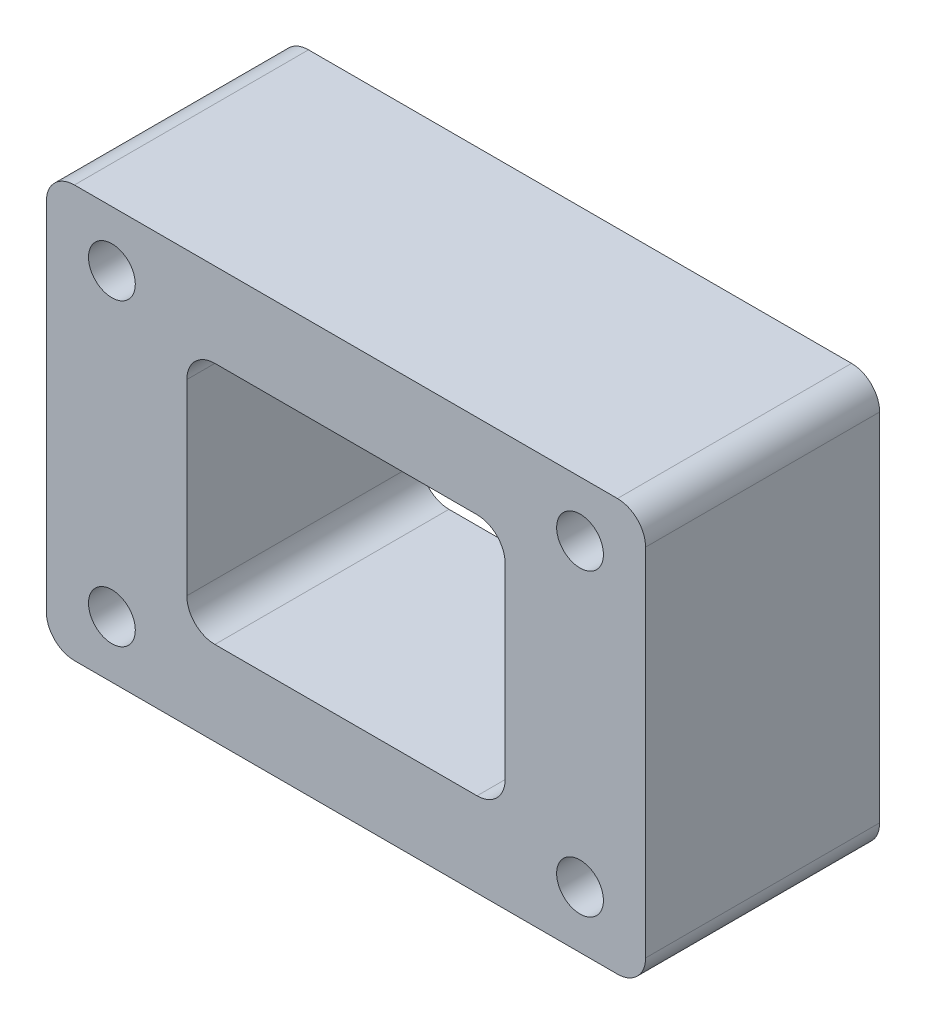
ISO-10303-21;
HEADER;
FILE_DESCRIPTION(('STEP AP214'),'2;1');
FILE_NAME('part.step','',(''),(''),'','','');
FILE_SCHEMA(('AUTOMOTIVE_DESIGN { 1 0 10303 214 1 1 1 1 }'));
ENDSEC;
DATA;
#1=APPLICATION_CONTEXT('core data for automotive mechanical design processes');
#2=APPLICATION_PROTOCOL_DEFINITION('international standard','automotive_design',2000,#1);
#3=PRODUCT_CONTEXT('',#1,'mechanical');
#4=PRODUCT('Part','Part','',(#3));
#5=PRODUCT_RELATED_PRODUCT_CATEGORY('part','',(#4));
#6=PRODUCT_DEFINITION_FORMATION('','',#4);
#7=PRODUCT_DEFINITION_CONTEXT('part definition',#1,'design');
#8=PRODUCT_DEFINITION('design','',#6,#7);
#9=PRODUCT_DEFINITION_SHAPE('','',#8);
#10=(LENGTH_UNIT() NAMED_UNIT(*) SI_UNIT(.MILLI.,.METRE.));
#11=(NAMED_UNIT(*) PLANE_ANGLE_UNIT() SI_UNIT($,.RADIAN.));
#12=(NAMED_UNIT(*) SI_UNIT($,.STERADIAN.) SOLID_ANGLE_UNIT());
#13=UNCERTAINTY_MEASURE_WITH_UNIT(LENGTH_MEASURE(1.E-05),#10,'distance_accuracy_value','');
#14=(GEOMETRIC_REPRESENTATION_CONTEXT(3) GLOBAL_UNCERTAINTY_ASSIGNED_CONTEXT((#13)) GLOBAL_UNIT_ASSIGNED_CONTEXT((#10,
#11,#12)) REPRESENTATION_CONTEXT('',''));
#15=CARTESIAN_POINT('',(0.,0.,0.));
#16=DIRECTION('',(0.,0.,1.));
#17=DIRECTION('',(1.,0.,0.));
#18=AXIS2_PLACEMENT_3D('',#15,#16,#17);
#19=CARTESIAN_POINT('',(0.,0.,25.));
#20=DIRECTION('',(0.,0.,1.));
#21=DIRECTION('',(1.,0.,0.));
#22=AXIS2_PLACEMENT_3D('',#19,#20,#21);
#23=PLANE('',#22);
#24=CARTESIAN_POINT('',(24.9999999999999,-15.9322033898305,25.));
#25=DIRECTION('',(0.,0.,1.));
#26=DIRECTION('',(-1.,0.,0.));
#27=AXIS2_PLACEMENT_3D('',#24,#25,#26);
#28=CIRCLE('',#27,2.5);
#29=CARTESIAN_POINT('',(22.4999999999999,-15.9322033898305,25.));
#30=VERTEX_POINT('',#29);
#31=EDGE_CURVE('E272',#30,#30,#28,.T.);
#32=ORIENTED_EDGE('',*,*,#31,.F.);
#33=EDGE_LOOP('',(#32));
#34=FACE_BOUND('',#33,.T.);
#35=CARTESIAN_POINT('',(-25.,16.0677966101695,25.));
#36=DIRECTION('',(0.,0.,1.));
#37=DIRECTION('',(1.,0.,0.));
#38=AXIS2_PLACEMENT_3D('',#35,#36,#37);
#39=CIRCLE('',#38,2.5);
#40=CARTESIAN_POINT('',(-22.5,16.0677966101695,25.));
#41=VERTEX_POINT('',#40);
#42=EDGE_CURVE('E280',#41,#41,#39,.T.);
#43=ORIENTED_EDGE('',*,*,#42,.F.);
#44=EDGE_LOOP('',(#43));
#45=FACE_BOUND('',#44,.T.);
#46=DIRECTION('',(0.,-1.,0.));
#47=VECTOR('',#46,1.);
#48=CARTESIAN_POINT('',(-32.,22.,25.));
#49=LINE('',#48,#47);
#50=CARTESIAN_POINT('',(-32.,19.,25.));
#51=VERTEX_POINT('',#50);
#52=CARTESIAN_POINT('',(-32.,-19.,25.));
#53=VERTEX_POINT('',#52);
#54=EDGE_CURVE('E177',#51,#53,#49,.T.);
#55=ORIENTED_EDGE('',*,*,#54,.T.);
#56=CARTESIAN_POINT('',(-29.,-19.,25.));
#57=DIRECTION('',(0.,0.,1.));
#58=DIRECTION('',(1.,0.,0.));
#59=AXIS2_PLACEMENT_3D('',#56,#57,#58);
#60=CIRCLE('',#59,3.);
#61=CARTESIAN_POINT('',(-29.,-22.,25.));
#62=VERTEX_POINT('',#61);
#63=EDGE_CURVE('E219',#53,#62,#60,.T.);
#64=ORIENTED_EDGE('',*,*,#63,.T.);
#65=DIRECTION('',(1.,0.,0.));
#66=VECTOR('',#65,1.);
#67=CARTESIAN_POINT('',(-32.,-22.,25.));
#68=LINE('',#67,#66);
#69=CARTESIAN_POINT('',(29.,-22.,25.));
#70=VERTEX_POINT('',#69);
#71=EDGE_CURVE('E172',#62,#70,#68,.T.);
#72=ORIENTED_EDGE('',*,*,#71,.T.);
#73=CARTESIAN_POINT('',(29.,-19.,25.));
#74=DIRECTION('',(0.,0.,1.));
#75=DIRECTION('',(1.,0.,0.));
#76=AXIS2_PLACEMENT_3D('',#73,#74,#75);
#77=CIRCLE('',#76,3.);
#78=CARTESIAN_POINT('',(32.,-19.,25.));
#79=VERTEX_POINT('',#78);
#80=EDGE_CURVE('E215',#70,#79,#77,.T.);
#81=ORIENTED_EDGE('',*,*,#80,.T.);
#82=DIRECTION('',(0.,1.,0.));
#83=VECTOR('',#82,1.);
#84=CARTESIAN_POINT('',(32.,22.,25.));
#85=LINE('',#84,#83);
#86=CARTESIAN_POINT('',(32.,19.,25.));
#87=VERTEX_POINT('',#86);
#88=EDGE_CURVE('E286',#79,#87,#85,.T.);
#89=ORIENTED_EDGE('',*,*,#88,.T.);
#90=CARTESIAN_POINT('',(29.,19.,25.));
#91=DIRECTION('',(0.,0.,1.));
#92=DIRECTION('',(1.,0.,0.));
#93=AXIS2_PLACEMENT_3D('',#90,#91,#92);
#94=CIRCLE('',#93,3.);
#95=CARTESIAN_POINT('',(29.,22.,25.));
#96=VERTEX_POINT('',#95);
#97=EDGE_CURVE('E54',#87,#96,#94,.T.);
#98=ORIENTED_EDGE('',*,*,#97,.T.);
#99=DIRECTION('',(-1.,0.,0.));
#100=VECTOR('',#99,1.);
#101=CARTESIAN_POINT('',(-32.,22.,25.));
#102=LINE('',#101,#100);
#103=CARTESIAN_POINT('',(-29.,22.,25.));
#104=VERTEX_POINT('',#103);
#105=EDGE_CURVE('E288',#96,#104,#102,.T.);
#106=ORIENTED_EDGE('',*,*,#105,.T.);
#107=CARTESIAN_POINT('',(-29.,19.,25.));
#108=DIRECTION('',(0.,0.,1.));
#109=DIRECTION('',(1.,0.,0.));
#110=AXIS2_PLACEMENT_3D('',#107,#108,#109);
#111=CIRCLE('',#110,3.);
#112=EDGE_CURVE('E217',#104,#51,#111,.T.);
#113=ORIENTED_EDGE('',*,*,#112,.T.);
#114=EDGE_LOOP('',(#55,#64,#72,#81,#89,#98,#106,#113));
#115=FACE_BOUND('',#114,.T.);
#116=CARTESIAN_POINT('',(-25.,-15.9322033898305,25.));
#117=DIRECTION('',(0.,0.,1.));
#118=DIRECTION('',(1.,0.,0.));
#119=AXIS2_PLACEMENT_3D('',#116,#117,#118);
#120=CIRCLE('',#119,2.5);
#121=CARTESIAN_POINT('',(-22.5,-15.9322033898305,25.));
#122=VERTEX_POINT('',#121);
#123=EDGE_CURVE('E274',#122,#122,#120,.T.);
#124=ORIENTED_EDGE('',*,*,#123,.F.);
#125=EDGE_LOOP('',(#124));
#126=FACE_BOUND('',#125,.T.);
#127=DIRECTION('',(-1.,0.,0.));
#128=VECTOR('',#127,1.);
#129=CARTESIAN_POINT('',(-17.,13.,25.));
#130=LINE('',#129,#128);
#131=CARTESIAN_POINT('',(14.,13.,25.));
#132=VERTEX_POINT('',#131);
#133=CARTESIAN_POINT('',(-14.,13.,25.));
#134=VERTEX_POINT('',#133);
#135=EDGE_CURVE('E254',#132,#134,#130,.T.);
#136=ORIENTED_EDGE('',*,*,#135,.F.);
#137=CARTESIAN_POINT('',(14.,10.,25.));
#138=DIRECTION('',(0.,0.,1.));
#139=DIRECTION('',(1.,0.,0.));
#140=AXIS2_PLACEMENT_3D('',#137,#138,#139);
#141=CIRCLE('',#140,3.);
#142=CARTESIAN_POINT('',(17.,10.,25.));
#143=VERTEX_POINT('',#142);
#144=EDGE_CURVE('E158',#132,#143,#141,.F.);
#145=ORIENTED_EDGE('',*,*,#144,.T.);
#146=DIRECTION('',(0.,1.,0.));
#147=VECTOR('',#146,1.);
#148=CARTESIAN_POINT('',(17.,13.,25.));
#149=LINE('',#148,#147);
#150=CARTESIAN_POINT('',(17.,-9.99999999999999,25.));
#151=VERTEX_POINT('',#150);
#152=EDGE_CURVE('E168',#151,#143,#149,.T.);
#153=ORIENTED_EDGE('',*,*,#152,.F.);
#154=CARTESIAN_POINT('',(14.,-9.99999999999999,25.));
#155=DIRECTION('',(0.,0.,1.));
#156=DIRECTION('',(1.,0.,0.));
#157=AXIS2_PLACEMENT_3D('',#154,#155,#156);
#158=CIRCLE('',#157,3.);
#159=CARTESIAN_POINT('',(14.,-13.,25.));
#160=VERTEX_POINT('',#159);
#161=EDGE_CURVE('E232',#151,#160,#158,.F.);
#162=ORIENTED_EDGE('',*,*,#161,.T.);
#163=DIRECTION('',(1.,0.,0.));
#164=VECTOR('',#163,1.);
#165=CARTESIAN_POINT('',(-17.,-13.,25.));
#166=LINE('',#165,#164);
#167=CARTESIAN_POINT('',(-14.,-13.,25.));
#168=VERTEX_POINT('',#167);
#169=EDGE_CURVE('E261',#168,#160,#166,.T.);
#170=ORIENTED_EDGE('',*,*,#169,.F.);
#171=CARTESIAN_POINT('',(-14.,-9.99999999999999,25.));
#172=DIRECTION('',(0.,0.,1.));
#173=DIRECTION('',(1.,0.,0.));
#174=AXIS2_PLACEMENT_3D('',#171,#172,#173);
#175=CIRCLE('',#174,3.);
#176=CARTESIAN_POINT('',(-17.,-9.99999999999999,25.));
#177=VERTEX_POINT('',#176);
#178=EDGE_CURVE('E157',#168,#177,#175,.F.);
#179=ORIENTED_EDGE('',*,*,#178,.T.);
#180=DIRECTION('',(0.,-1.,0.));
#181=VECTOR('',#180,1.);
#182=CARTESIAN_POINT('',(-17.,13.,25.));
#183=LINE('',#182,#181);
#184=CARTESIAN_POINT('',(-17.,10.,25.));
#185=VERTEX_POINT('',#184);
#186=EDGE_CURVE('E256',#185,#177,#183,.T.);
#187=ORIENTED_EDGE('',*,*,#186,.F.);
#188=CARTESIAN_POINT('',(-14.,10.,25.));
#189=DIRECTION('',(0.,0.,1.));
#190=DIRECTION('',(1.,0.,0.));
#191=AXIS2_PLACEMENT_3D('',#188,#189,#190);
#192=CIRCLE('',#191,3.);
#193=EDGE_CURVE('E11',#185,#134,#192,.F.);
#194=ORIENTED_EDGE('',*,*,#193,.T.);
#195=EDGE_LOOP('',(#136,#145,#153,#162,#170,#179,#187,#194));
#196=FACE_BOUND('',#195,.T.);
#197=CARTESIAN_POINT('',(25.,16.0677966101694,25.));
#198=DIRECTION('',(0.,0.,1.));
#199=DIRECTION('',(-1.,0.,0.));
#200=AXIS2_PLACEMENT_3D('',#197,#198,#199);
#201=CIRCLE('',#200,2.5);
#202=CARTESIAN_POINT('',(22.5,16.0677966101694,25.));
#203=VERTEX_POINT('',#202);
#204=EDGE_CURVE('E540',#203,#203,#201,.T.);
#205=ORIENTED_EDGE('',*,*,#204,.F.);
#206=EDGE_LOOP('',(#205));
#207=FACE_BOUND('',#206,.T.);
#208=ADVANCED_FACE('F32',(#34,#45,#115,#126,#196,#207),#23,.T.);
#209=CARTESIAN_POINT('',(0.,0.,0.));
#210=DIRECTION('',(0.,0.,1.));
#211=DIRECTION('',(1.,0.,0.));
#212=AXIS2_PLACEMENT_3D('',#209,#210,#211);
#213=PLANE('',#212);
#214=CARTESIAN_POINT('',(-25.,-15.9322033898305,0.));
#215=DIRECTION('',(0.,0.,1.));
#216=DIRECTION('',(1.,0.,0.));
#217=AXIS2_PLACEMENT_3D('',#214,#215,#216);
#218=CIRCLE('',#217,2.5);
#219=CARTESIAN_POINT('',(-22.5,-15.9322033898305,0.));
#220=VERTEX_POINT('',#219);
#221=EDGE_CURVE('E268',#220,#220,#218,.T.);
#222=ORIENTED_EDGE('',*,*,#221,.T.);
#223=EDGE_LOOP('',(#222));
#224=FACE_BOUND('',#223,.T.);
#225=CARTESIAN_POINT('',(-25.,16.0677966101695,0.));
#226=DIRECTION('',(0.,0.,1.));
#227=DIRECTION('',(1.,0.,0.));
#228=AXIS2_PLACEMENT_3D('',#225,#226,#227);
#229=CIRCLE('',#228,2.5);
#230=CARTESIAN_POINT('',(-22.5,16.0677966101695,0.));
#231=VERTEX_POINT('',#230);
#232=EDGE_CURVE('E277',#231,#231,#229,.T.);
#233=ORIENTED_EDGE('',*,*,#232,.T.);
#234=EDGE_LOOP('',(#233));
#235=FACE_BOUND('',#234,.T.);
#236=DIRECTION('',(1.,0.,0.));
#237=VECTOR('',#236,1.);
#238=CARTESIAN_POINT('',(-32.,-22.,0.));
#239=LINE('',#238,#237);
#240=CARTESIAN_POINT('',(-29.,-22.,0.));
#241=VERTEX_POINT('',#240);
#242=CARTESIAN_POINT('',(29.,-22.,0.));
#243=VERTEX_POINT('',#242);
#244=EDGE_CURVE('E180',#241,#243,#239,.T.);
#245=ORIENTED_EDGE('',*,*,#244,.F.);
#246=CARTESIAN_POINT('',(-29.,-19.,0.));
#247=DIRECTION('',(0.,0.,1.));
#248=DIRECTION('',(1.,0.,0.));
#249=AXIS2_PLACEMENT_3D('',#246,#247,#248);
#250=CIRCLE('',#249,3.);
#251=CARTESIAN_POINT('',(-32.,-19.,0.));
#252=VERTEX_POINT('',#251);
#253=EDGE_CURVE('E207',#241,#252,#250,.F.);
#254=ORIENTED_EDGE('',*,*,#253,.T.);
#255=DIRECTION('',(0.,-1.,0.));
#256=VECTOR('',#255,1.);
#257=CARTESIAN_POINT('',(-32.,22.,0.));
#258=LINE('',#257,#256);
#259=CARTESIAN_POINT('',(-32.,19.,0.));
#260=VERTEX_POINT('',#259);
#261=EDGE_CURVE('E295',#260,#252,#258,.T.);
#262=ORIENTED_EDGE('',*,*,#261,.F.);
#263=CARTESIAN_POINT('',(-29.,19.,0.));
#264=DIRECTION('',(0.,0.,1.));
#265=DIRECTION('',(1.,0.,0.));
#266=AXIS2_PLACEMENT_3D('',#263,#264,#265);
#267=CIRCLE('',#266,3.);
#268=CARTESIAN_POINT('',(-29.,22.,0.));
#269=VERTEX_POINT('',#268);
#270=EDGE_CURVE('E205',#260,#269,#267,.F.);
#271=ORIENTED_EDGE('',*,*,#270,.T.);
#272=DIRECTION('',(-1.,0.,0.));
#273=VECTOR('',#272,1.);
#274=CARTESIAN_POINT('',(-32.,22.,0.));
#275=LINE('',#274,#273);
#276=CARTESIAN_POINT('',(29.,22.,0.));
#277=VERTEX_POINT('',#276);
#278=EDGE_CURVE('E294',#277,#269,#275,.T.);
#279=ORIENTED_EDGE('',*,*,#278,.F.);
#280=CARTESIAN_POINT('',(29.,19.,0.));
#281=DIRECTION('',(0.,0.,1.));
#282=DIRECTION('',(1.,0.,0.));
#283=AXIS2_PLACEMENT_3D('',#280,#281,#282);
#284=CIRCLE('',#283,3.);
#285=CARTESIAN_POINT('',(32.,19.,0.));
#286=VERTEX_POINT('',#285);
#287=EDGE_CURVE('E201',#277,#286,#284,.F.);
#288=ORIENTED_EDGE('',*,*,#287,.T.);
#289=DIRECTION('',(0.,1.,0.));
#290=VECTOR('',#289,1.);
#291=CARTESIAN_POINT('',(32.,22.,0.));
#292=LINE('',#291,#290);
#293=CARTESIAN_POINT('',(32.,-19.,0.));
#294=VERTEX_POINT('',#293);
#295=EDGE_CURVE('E283',#294,#286,#292,.T.);
#296=ORIENTED_EDGE('',*,*,#295,.F.);
#297=CARTESIAN_POINT('',(29.,-19.,0.));
#298=DIRECTION('',(0.,0.,1.));
#299=DIRECTION('',(1.,0.,0.));
#300=AXIS2_PLACEMENT_3D('',#297,#298,#299);
#301=CIRCLE('',#300,3.);
#302=EDGE_CURVE('E203',#294,#243,#301,.F.);
#303=ORIENTED_EDGE('',*,*,#302,.T.);
#304=EDGE_LOOP('',(#245,#254,#262,#271,#279,#288,#296,#303));
#305=FACE_BOUND('',#304,.T.);
#306=DIRECTION('',(1.,0.,0.));
#307=VECTOR('',#306,1.);
#308=CARTESIAN_POINT('',(-17.,-13.,0.));
#309=LINE('',#308,#307);
#310=CARTESIAN_POINT('',(-14.,-13.,0.));
#311=VERTEX_POINT('',#310);
#312=CARTESIAN_POINT('',(14.,-13.,0.));
#313=VERTEX_POINT('',#312);
#314=EDGE_CURVE('E150',#311,#313,#309,.T.);
#315=ORIENTED_EDGE('',*,*,#314,.T.);
#316=CARTESIAN_POINT('',(14.,-9.99999999999999,0.));
#317=DIRECTION('',(0.,0.,1.));
#318=DIRECTION('',(1.,0.,0.));
#319=AXIS2_PLACEMENT_3D('',#316,#317,#318);
#320=CIRCLE('',#319,3.);
#321=CARTESIAN_POINT('',(17.,-9.99999999999999,0.));
#322=VERTEX_POINT('',#321);
#323=EDGE_CURVE('E230',#313,#322,#320,.T.);
#324=ORIENTED_EDGE('',*,*,#323,.T.);
#325=DIRECTION('',(0.,1.,0.));
#326=VECTOR('',#325,1.);
#327=CARTESIAN_POINT('',(17.,13.,0.));
#328=LINE('',#327,#326);
#329=CARTESIAN_POINT('',(17.,10.,0.));
#330=VERTEX_POINT('',#329);
#331=EDGE_CURVE('E269',#322,#330,#328,.T.);
#332=ORIENTED_EDGE('',*,*,#331,.T.);
#333=CARTESIAN_POINT('',(14.,10.,0.));
#334=DIRECTION('',(0.,0.,1.));
#335=DIRECTION('',(1.,0.,0.));
#336=AXIS2_PLACEMENT_3D('',#333,#334,#335);
#337=CIRCLE('',#336,3.);
#338=CARTESIAN_POINT('',(14.,13.,0.));
#339=VERTEX_POINT('',#338);
#340=EDGE_CURVE('E234',#330,#339,#337,.T.);
#341=ORIENTED_EDGE('',*,*,#340,.T.);
#342=DIRECTION('',(-1.,0.,0.));
#343=VECTOR('',#342,1.);
#344=CARTESIAN_POINT('',(-17.,13.,0.));
#345=LINE('',#344,#343);
#346=CARTESIAN_POINT('',(-14.,13.,0.));
#347=VERTEX_POINT('',#346);
#348=EDGE_CURVE('E239',#339,#347,#345,.T.);
#349=ORIENTED_EDGE('',*,*,#348,.T.);
#350=CARTESIAN_POINT('',(-14.,10.,0.));
#351=DIRECTION('',(0.,0.,1.));
#352=DIRECTION('',(1.,0.,0.));
#353=AXIS2_PLACEMENT_3D('',#350,#351,#352);
#354=CIRCLE('',#353,3.);
#355=CARTESIAN_POINT('',(-17.,10.,0.));
#356=VERTEX_POINT('',#355);
#357=EDGE_CURVE('E40',#347,#356,#354,.T.);
#358=ORIENTED_EDGE('',*,*,#357,.T.);
#359=DIRECTION('',(0.,-1.,0.));
#360=VECTOR('',#359,1.);
#361=CARTESIAN_POINT('',(-17.,13.,0.));
#362=LINE('',#361,#360);
#363=CARTESIAN_POINT('',(-17.,-9.99999999999999,0.));
#364=VERTEX_POINT('',#363);
#365=EDGE_CURVE('E152',#356,#364,#362,.T.);
#366=ORIENTED_EDGE('',*,*,#365,.T.);
#367=CARTESIAN_POINT('',(-14.,-9.99999999999999,0.));
#368=DIRECTION('',(0.,0.,1.));
#369=DIRECTION('',(1.,0.,0.));
#370=AXIS2_PLACEMENT_3D('',#367,#368,#369);
#371=CIRCLE('',#370,3.);
#372=EDGE_CURVE('E146',#364,#311,#371,.T.);
#373=ORIENTED_EDGE('',*,*,#372,.T.);
#374=EDGE_LOOP('',(#315,#324,#332,#341,#349,#358,#366,#373));
#375=FACE_BOUND('',#374,.T.);
#376=CARTESIAN_POINT('',(24.9999999999999,-15.9322033898305,0.));
#377=DIRECTION('',(0.,0.,1.));
#378=DIRECTION('',(-1.,0.,0.));
#379=AXIS2_PLACEMENT_3D('',#376,#377,#378);
#380=CIRCLE('',#379,2.5);
#381=CARTESIAN_POINT('',(22.4999999999999,-15.9322033898305,0.));
#382=VERTEX_POINT('',#381);
#383=EDGE_CURVE('E539',#382,#382,#380,.T.);
#384=ORIENTED_EDGE('',*,*,#383,.T.);
#385=EDGE_LOOP('',(#384));
#386=FACE_BOUND('',#385,.T.);
#387=CARTESIAN_POINT('',(25.,16.0677966101694,0.));
#388=DIRECTION('',(0.,0.,1.));
#389=DIRECTION('',(-1.,0.,0.));
#390=AXIS2_PLACEMENT_3D('',#387,#388,#389);
#391=CIRCLE('',#390,2.5);
#392=CARTESIAN_POINT('',(22.5,16.0677966101694,0.));
#393=VERTEX_POINT('',#392);
#394=EDGE_CURVE('E543',#393,#393,#391,.T.);
#395=ORIENTED_EDGE('',*,*,#394,.T.);
#396=EDGE_LOOP('',(#395));
#397=FACE_BOUND('',#396,.T.);
#398=ADVANCED_FACE('F148',(#224,#235,#305,#375,#386,#397),#213,.F.);
#399=CARTESIAN_POINT('',(32.,22.,25.));
#400=DIRECTION('',(-1.,0.,0.));
#401=DIRECTION('',(0.,0.,1.));
#402=AXIS2_PLACEMENT_3D('',#399,#400,#401);
#403=PLANE('',#402);
#404=ORIENTED_EDGE('',*,*,#88,.F.);
#405=DIRECTION('',(0.,0.,-1.));
#406=VECTOR('',#405,1.);
#407=CARTESIAN_POINT('',(32.,-19.,25.));
#408=LINE('',#407,#406);
#409=EDGE_CURVE('E227',#79,#294,#408,.T.);
#410=ORIENTED_EDGE('',*,*,#409,.T.);
#411=ORIENTED_EDGE('',*,*,#295,.T.);
#412=DIRECTION('',(0.,0.,-1.));
#413=VECTOR('',#412,1.);
#414=CARTESIAN_POINT('',(32.,19.,25.));
#415=LINE('',#414,#413);
#416=EDGE_CURVE('E225',#286,#87,#415,.F.);
#417=ORIENTED_EDGE('',*,*,#416,.T.);
#418=EDGE_LOOP('',(#404,#410,#411,#417));
#419=FACE_BOUND('',#418,.T.);
#420=ADVANCED_FACE('F315',(#419),#403,.F.);
#421=CARTESIAN_POINT('',(-32.,22.,25.));
#422=DIRECTION('',(0.,-1.,0.));
#423=DIRECTION('',(0.,0.,-1.));
#424=AXIS2_PLACEMENT_3D('',#421,#422,#423);
#425=PLANE('',#424);
#426=ORIENTED_EDGE('',*,*,#278,.T.);
#427=DIRECTION('',(0.,0.,-1.));
#428=VECTOR('',#427,1.);
#429=CARTESIAN_POINT('',(-29.,22.,25.));
#430=LINE('',#429,#428);
#431=EDGE_CURVE('E47',#269,#104,#430,.F.);
#432=ORIENTED_EDGE('',*,*,#431,.T.);
#433=ORIENTED_EDGE('',*,*,#105,.F.);
#434=DIRECTION('',(0.,0.,-1.));
#435=VECTOR('',#434,1.);
#436=CARTESIAN_POINT('',(29.,22.,25.));
#437=LINE('',#436,#435);
#438=EDGE_CURVE('E221',#96,#277,#437,.T.);
#439=ORIENTED_EDGE('',*,*,#438,.T.);
#440=EDGE_LOOP('',(#426,#432,#433,#439));
#441=FACE_BOUND('',#440,.T.);
#442=ADVANCED_FACE('F321',(#441),#425,.F.);
#443=CARTESIAN_POINT('',(-32.,22.,25.));
#444=DIRECTION('',(1.,0.,0.));
#445=DIRECTION('',(0.,1.,0.));
#446=AXIS2_PLACEMENT_3D('',#443,#444,#445);
#447=PLANE('',#446);
#448=ORIENTED_EDGE('',*,*,#261,.T.);
#449=DIRECTION('',(0.,0.,-1.));
#450=VECTOR('',#449,1.);
#451=CARTESIAN_POINT('',(-32.,-19.,25.));
#452=LINE('',#451,#450);
#453=EDGE_CURVE('E212',#252,#53,#452,.F.);
#454=ORIENTED_EDGE('',*,*,#453,.T.);
#455=ORIENTED_EDGE('',*,*,#54,.F.);
#456=DIRECTION('',(0.,0.,-1.));
#457=VECTOR('',#456,1.);
#458=CARTESIAN_POINT('',(-32.,19.,25.));
#459=LINE('',#458,#457);
#460=EDGE_CURVE('E209',#51,#260,#459,.T.);
#461=ORIENTED_EDGE('',*,*,#460,.T.);
#462=EDGE_LOOP('',(#448,#454,#455,#461));
#463=FACE_BOUND('',#462,.T.);
#464=ADVANCED_FACE('F327',(#463),#447,.F.);
#465=CARTESIAN_POINT('',(-32.,-22.,25.));
#466=DIRECTION('',(0.,1.,0.));
#467=DIRECTION('',(0.,0.,1.));
#468=AXIS2_PLACEMENT_3D('',#465,#466,#467);
#469=PLANE('',#468);
#470=ORIENTED_EDGE('',*,*,#71,.F.);
#471=DIRECTION('',(0.,0.,-1.));
#472=VECTOR('',#471,1.);
#473=CARTESIAN_POINT('',(-29.,-22.,25.));
#474=LINE('',#473,#472);
#475=EDGE_CURVE('E198',#62,#241,#474,.T.);
#476=ORIENTED_EDGE('',*,*,#475,.T.);
#477=ORIENTED_EDGE('',*,*,#244,.T.);
#478=DIRECTION('',(0.,0.,-1.));
#479=VECTOR('',#478,1.);
#480=CARTESIAN_POINT('',(29.,-22.,25.));
#481=LINE('',#480,#479);
#482=EDGE_CURVE('E196',#243,#70,#481,.F.);
#483=ORIENTED_EDGE('',*,*,#482,.T.);
#484=EDGE_LOOP('',(#470,#476,#477,#483));
#485=FACE_BOUND('',#484,.T.);
#486=ADVANCED_FACE('F305',(#485),#469,.F.);
#487=CARTESIAN_POINT('',(-25.,16.0677966101695,25.));
#488=DIRECTION('',(0.,0.,-1.));
#489=DIRECTION('',(-1.,0.,0.));
#490=AXIS2_PLACEMENT_3D('',#487,#488,#489);
#491=CYLINDRICAL_SURFACE('',#490,2.5);
#492=ORIENTED_EDGE('',*,*,#42,.T.);
#493=EDGE_LOOP('',(#492));
#494=FACE_BOUND('',#493,.T.);
#495=ORIENTED_EDGE('',*,*,#232,.F.);
#496=EDGE_LOOP('',(#495));
#497=FACE_BOUND('',#496,.T.);
#498=ADVANCED_FACE('F350',(#494,#497),#491,.F.);
#499=CARTESIAN_POINT('',(-25.,-15.9322033898305,25.));
#500=DIRECTION('',(0.,0.,-1.));
#501=DIRECTION('',(-1.,0.,0.));
#502=AXIS2_PLACEMENT_3D('',#499,#500,#501);
#503=CYLINDRICAL_SURFACE('',#502,2.5);
#504=ORIENTED_EDGE('',*,*,#123,.T.);
#505=EDGE_LOOP('',(#504));
#506=FACE_BOUND('',#505,.T.);
#507=ORIENTED_EDGE('',*,*,#221,.F.);
#508=EDGE_LOOP('',(#507));
#509=FACE_BOUND('',#508,.T.);
#510=ADVANCED_FACE('F464',(#506,#509),#503,.F.);
#511=CARTESIAN_POINT('',(17.,13.,25.));
#512=DIRECTION('',(-1.,0.,0.));
#513=DIRECTION('',(0.,0.,1.));
#514=AXIS2_PLACEMENT_3D('',#511,#512,#513);
#515=PLANE('',#514);
#516=ORIENTED_EDGE('',*,*,#331,.F.);
#517=DIRECTION('',(0.,0.,-1.));
#518=VECTOR('',#517,1.);
#519=CARTESIAN_POINT('',(17.,-9.99999999999999,25.));
#520=LINE('',#519,#518);
#521=EDGE_CURVE('E185',#322,#151,#520,.F.);
#522=ORIENTED_EDGE('',*,*,#521,.T.);
#523=ORIENTED_EDGE('',*,*,#152,.T.);
#524=DIRECTION('',(0.,0.,-1.));
#525=VECTOR('',#524,1.);
#526=CARTESIAN_POINT('',(17.,10.,0.));
#527=LINE('',#526,#525);
#528=EDGE_CURVE('E174',#143,#330,#527,.T.);
#529=ORIENTED_EDGE('',*,*,#528,.T.);
#530=EDGE_LOOP('',(#516,#522,#523,#529));
#531=FACE_BOUND('',#530,.T.);
#532=ADVANCED_FACE('F456',(#531),#515,.T.);
#533=CARTESIAN_POINT('',(-17.,13.,25.));
#534=DIRECTION('',(0.,-1.,0.));
#535=DIRECTION('',(0.,0.,-1.));
#536=AXIS2_PLACEMENT_3D('',#533,#534,#535);
#537=PLANE('',#536);
#538=ORIENTED_EDGE('',*,*,#348,.F.);
#539=DIRECTION('',(0.,0.,-1.));
#540=VECTOR('',#539,1.);
#541=CARTESIAN_POINT('',(14.,13.,25.));
#542=LINE('',#541,#540);
#543=EDGE_CURVE('E190',#339,#132,#542,.F.);
#544=ORIENTED_EDGE('',*,*,#543,.T.);
#545=ORIENTED_EDGE('',*,*,#135,.T.);
#546=DIRECTION('',(0.,0.,-1.));
#547=VECTOR('',#546,1.);
#548=CARTESIAN_POINT('',(-14.,13.,0.));
#549=LINE('',#548,#547);
#550=EDGE_CURVE('E187',#134,#347,#549,.T.);
#551=ORIENTED_EDGE('',*,*,#550,.T.);
#552=EDGE_LOOP('',(#538,#544,#545,#551));
#553=FACE_BOUND('',#552,.T.);
#554=ADVANCED_FACE('F258',(#553),#537,.T.);
#555=CARTESIAN_POINT('',(-17.,13.,25.));
#556=DIRECTION('',(1.,0.,0.));
#557=DIRECTION('',(0.,1.,0.));
#558=AXIS2_PLACEMENT_3D('',#555,#556,#557);
#559=PLANE('',#558);
#560=ORIENTED_EDGE('',*,*,#186,.T.);
#561=DIRECTION('',(0.,0.,-1.));
#562=VECTOR('',#561,1.);
#563=CARTESIAN_POINT('',(-17.,-9.99999999999999,0.));
#564=LINE('',#563,#562);
#565=EDGE_CURVE('E194',#177,#364,#564,.T.);
#566=ORIENTED_EDGE('',*,*,#565,.T.);
#567=ORIENTED_EDGE('',*,*,#365,.F.);
#568=DIRECTION('',(0.,0.,-1.));
#569=VECTOR('',#568,1.);
#570=CARTESIAN_POINT('',(-17.,10.,25.));
#571=LINE('',#570,#569);
#572=EDGE_CURVE('E192',#356,#185,#571,.F.);
#573=ORIENTED_EDGE('',*,*,#572,.T.);
#574=EDGE_LOOP('',(#560,#566,#567,#573));
#575=FACE_BOUND('',#574,.T.);
#576=ADVANCED_FACE('F245',(#575),#559,.T.);
#577=CARTESIAN_POINT('',(-17.,-13.,25.));
#578=DIRECTION('',(0.,1.,0.));
#579=DIRECTION('',(0.,0.,1.));
#580=AXIS2_PLACEMENT_3D('',#577,#578,#579);
#581=PLANE('',#580);
#582=ORIENTED_EDGE('',*,*,#169,.T.);
#583=DIRECTION('',(0.,0.,-1.));
#584=VECTOR('',#583,1.);
#585=CARTESIAN_POINT('',(14.,-13.,0.));
#586=LINE('',#585,#584);
#587=EDGE_CURVE('E167',#160,#313,#586,.T.);
#588=ORIENTED_EDGE('',*,*,#587,.T.);
#589=ORIENTED_EDGE('',*,*,#314,.F.);
#590=DIRECTION('',(0.,0.,-1.));
#591=VECTOR('',#590,1.);
#592=CARTESIAN_POINT('',(-14.,-13.,25.));
#593=LINE('',#592,#591);
#594=EDGE_CURVE('E164',#311,#168,#593,.F.);
#595=ORIENTED_EDGE('',*,*,#594,.T.);
#596=EDGE_LOOP('',(#582,#588,#589,#595));
#597=FACE_BOUND('',#596,.T.);
#598=ADVANCED_FACE('F163',(#597),#581,.T.);
#599=CARTESIAN_POINT('',(24.9999999999999,-15.9322033898305,25.));
#600=DIRECTION('',(0.,0.,-1.));
#601=DIRECTION('',(-1.,0.,0.));
#602=AXIS2_PLACEMENT_3D('',#599,#600,#601);
#603=CYLINDRICAL_SURFACE('',#602,2.5);
#604=ORIENTED_EDGE('',*,*,#31,.T.);
#605=EDGE_LOOP('',(#604));
#606=FACE_BOUND('',#605,.T.);
#607=ORIENTED_EDGE('',*,*,#383,.F.);
#608=EDGE_LOOP('',(#607));
#609=FACE_BOUND('',#608,.T.);
#610=ADVANCED_FACE('F425',(#606,#609),#603,.F.);
#611=CARTESIAN_POINT('',(25.,16.0677966101694,25.));
#612=DIRECTION('',(0.,0.,-1.));
#613=DIRECTION('',(-1.,0.,0.));
#614=AXIS2_PLACEMENT_3D('',#611,#612,#613);
#615=CYLINDRICAL_SURFACE('',#614,2.5);
#616=ORIENTED_EDGE('',*,*,#204,.T.);
#617=EDGE_LOOP('',(#616));
#618=FACE_BOUND('',#617,.T.);
#619=ORIENTED_EDGE('',*,*,#394,.F.);
#620=EDGE_LOOP('',(#619));
#621=FACE_BOUND('',#620,.T.);
#622=ADVANCED_FACE('F365',(#618,#621),#615,.F.);
#623=CARTESIAN_POINT('',(14.,-9.99999999999999,25.));
#624=DIRECTION('',(0.,0.,1.));
#625=DIRECTION('',(1.,0.,0.));
#626=AXIS2_PLACEMENT_3D('',#623,#624,#625);
#627=CYLINDRICAL_SURFACE('',#626,3.);
#628=ORIENTED_EDGE('',*,*,#161,.F.);
#629=ORIENTED_EDGE('',*,*,#521,.F.);
#630=ORIENTED_EDGE('',*,*,#323,.F.);
#631=ORIENTED_EDGE('',*,*,#587,.F.);
#632=EDGE_LOOP('',(#628,#629,#630,#631));
#633=FACE_BOUND('',#632,.T.);
#634=ADVANCED_FACE('F361',(#633),#627,.F.);
#635=CARTESIAN_POINT('',(14.,10.,25.));
#636=DIRECTION('',(0.,0.,1.));
#637=DIRECTION('',(1.,0.,0.));
#638=AXIS2_PLACEMENT_3D('',#635,#636,#637);
#639=CYLINDRICAL_SURFACE('',#638,3.);
#640=ORIENTED_EDGE('',*,*,#144,.F.);
#641=ORIENTED_EDGE('',*,*,#543,.F.);
#642=ORIENTED_EDGE('',*,*,#340,.F.);
#643=ORIENTED_EDGE('',*,*,#528,.F.);
#644=EDGE_LOOP('',(#640,#641,#642,#643));
#645=FACE_BOUND('',#644,.T.);
#646=ADVANCED_FACE('F364',(#645),#639,.F.);
#647=CARTESIAN_POINT('',(-14.,-9.99999999999999,25.));
#648=DIRECTION('',(0.,0.,1.));
#649=DIRECTION('',(1.,0.,0.));
#650=AXIS2_PLACEMENT_3D('',#647,#648,#649);
#651=CYLINDRICAL_SURFACE('',#650,3.);
#652=ORIENTED_EDGE('',*,*,#178,.F.);
#653=ORIENTED_EDGE('',*,*,#594,.F.);
#654=ORIENTED_EDGE('',*,*,#372,.F.);
#655=ORIENTED_EDGE('',*,*,#565,.F.);
#656=EDGE_LOOP('',(#652,#653,#654,#655));
#657=FACE_BOUND('',#656,.T.);
#658=ADVANCED_FACE('F171',(#657),#651,.F.);
#659=CARTESIAN_POINT('',(-14.,10.,25.));
#660=DIRECTION('',(0.,0.,1.));
#661=DIRECTION('',(1.,0.,0.));
#662=AXIS2_PLACEMENT_3D('',#659,#660,#661);
#663=CYLINDRICAL_SURFACE('',#662,3.);
#664=ORIENTED_EDGE('',*,*,#193,.F.);
#665=ORIENTED_EDGE('',*,*,#572,.F.);
#666=ORIENTED_EDGE('',*,*,#357,.F.);
#667=ORIENTED_EDGE('',*,*,#550,.F.);
#668=EDGE_LOOP('',(#664,#665,#666,#667));
#669=FACE_BOUND('',#668,.T.);
#670=ADVANCED_FACE('F249',(#669),#663,.F.);
#671=CARTESIAN_POINT('',(-29.,-19.,25.));
#672=DIRECTION('',(0.,0.,-1.));
#673=DIRECTION('',(-1.,0.,0.));
#674=AXIS2_PLACEMENT_3D('',#671,#672,#673);
#675=CYLINDRICAL_SURFACE('',#674,3.);
#676=ORIENTED_EDGE('',*,*,#63,.F.);
#677=ORIENTED_EDGE('',*,*,#453,.F.);
#678=ORIENTED_EDGE('',*,*,#253,.F.);
#679=ORIENTED_EDGE('',*,*,#475,.F.);
#680=EDGE_LOOP('',(#676,#677,#678,#679));
#681=FACE_BOUND('',#680,.T.);
#682=ADVANCED_FACE('F330',(#681),#675,.T.);
#683=CARTESIAN_POINT('',(-29.,19.,25.));
#684=DIRECTION('',(0.,0.,-1.));
#685=DIRECTION('',(-1.,0.,0.));
#686=AXIS2_PLACEMENT_3D('',#683,#684,#685);
#687=CYLINDRICAL_SURFACE('',#686,3.);
#688=ORIENTED_EDGE('',*,*,#112,.F.);
#689=ORIENTED_EDGE('',*,*,#431,.F.);
#690=ORIENTED_EDGE('',*,*,#270,.F.);
#691=ORIENTED_EDGE('',*,*,#460,.F.);
#692=EDGE_LOOP('',(#688,#689,#690,#691));
#693=FACE_BOUND('',#692,.T.);
#694=ADVANCED_FACE('F325',(#693),#687,.T.);
#695=CARTESIAN_POINT('',(29.,-19.,25.));
#696=DIRECTION('',(0.,0.,-1.));
#697=DIRECTION('',(-1.,0.,0.));
#698=AXIS2_PLACEMENT_3D('',#695,#696,#697);
#699=CYLINDRICAL_SURFACE('',#698,3.);
#700=ORIENTED_EDGE('',*,*,#80,.F.);
#701=ORIENTED_EDGE('',*,*,#482,.F.);
#702=ORIENTED_EDGE('',*,*,#302,.F.);
#703=ORIENTED_EDGE('',*,*,#409,.F.);
#704=EDGE_LOOP('',(#700,#701,#702,#703));
#705=FACE_BOUND('',#704,.T.);
#706=ADVANCED_FACE('F310',(#705),#699,.T.);
#707=CARTESIAN_POINT('',(29.,19.,25.));
#708=DIRECTION('',(0.,0.,-1.));
#709=DIRECTION('',(-1.,0.,0.));
#710=AXIS2_PLACEMENT_3D('',#707,#708,#709);
#711=CYLINDRICAL_SURFACE('',#710,3.);
#712=ORIENTED_EDGE('',*,*,#97,.F.);
#713=ORIENTED_EDGE('',*,*,#416,.F.);
#714=ORIENTED_EDGE('',*,*,#287,.F.);
#715=ORIENTED_EDGE('',*,*,#438,.F.);
#716=EDGE_LOOP('',(#712,#713,#714,#715));
#717=FACE_BOUND('',#716,.T.);
#718=ADVANCED_FACE('F34',(#717),#711,.T.);
#719=CLOSED_SHELL('',(#208,#398,#420,#442,#464,#486,#498,#510,#532,#554,#576,#598,#610,#622,
#634,#646,#658,#670,#682,#694,#706,#718));
#720=MANIFOLD_SOLID_BREP('B2',#719);
#721=ADVANCED_BREP_SHAPE_REPRESENTATION('',(#18,#720),#14);
#722=SHAPE_DEFINITION_REPRESENTATION(#9,#721);
ENDSEC;
END-ISO-10303-21;
